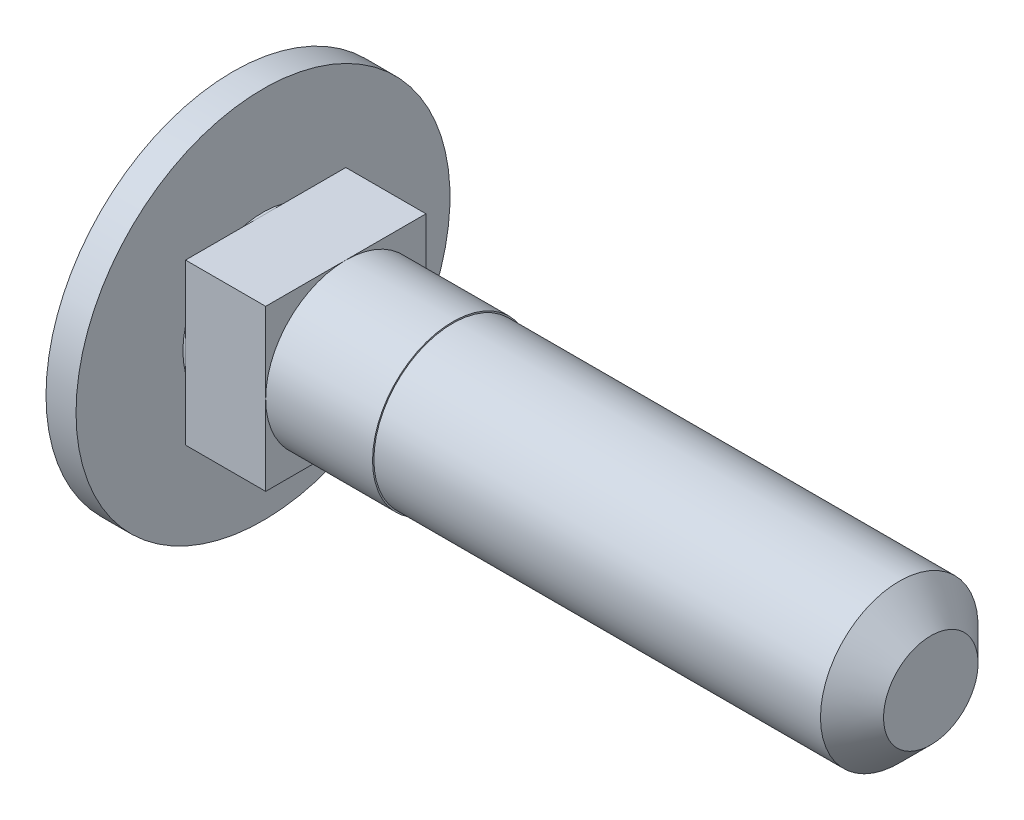
ISO-10303-21;
HEADER;
FILE_DESCRIPTION(('STEP AP214'),'2;1');
FILE_NAME('part.step','',(''),(''),'','','');
FILE_SCHEMA(('AUTOMOTIVE_DESIGN { 1 0 10303 214 1 1 1 1 }'));
ENDSEC;
DATA;
#1=APPLICATION_CONTEXT('core data for automotive mechanical design processes');
#2=APPLICATION_PROTOCOL_DEFINITION('international standard','automotive_design',2000,#1);
#3=PRODUCT_CONTEXT('',#1,'mechanical');
#4=PRODUCT('Part','Part','',(#3));
#5=PRODUCT_RELATED_PRODUCT_CATEGORY('part','',(#4));
#6=PRODUCT_DEFINITION_FORMATION('','',#4);
#7=PRODUCT_DEFINITION_CONTEXT('part definition',#1,'design');
#8=PRODUCT_DEFINITION('design','',#6,#7);
#9=PRODUCT_DEFINITION_SHAPE('','',#8);
#10=(LENGTH_UNIT() NAMED_UNIT(*) SI_UNIT(.MILLI.,.METRE.));
#11=(NAMED_UNIT(*) PLANE_ANGLE_UNIT() SI_UNIT($,.RADIAN.));
#12=(NAMED_UNIT(*) SI_UNIT($,.STERADIAN.) SOLID_ANGLE_UNIT());
#13=UNCERTAINTY_MEASURE_WITH_UNIT(LENGTH_MEASURE(1.E-05),#10,'distance_accuracy_value','');
#14=(GEOMETRIC_REPRESENTATION_CONTEXT(3) GLOBAL_UNCERTAINTY_ASSIGNED_CONTEXT((#13)) GLOBAL_UNIT_ASSIGNED_CONTEXT((#10,
#11,#12)) REPRESENTATION_CONTEXT('',''));
#15=CARTESIAN_POINT('',(0.,0.,0.));
#16=DIRECTION('',(0.,0.,1.));
#17=DIRECTION('',(1.,0.,0.));
#18=AXIS2_PLACEMENT_3D('',#15,#16,#17);
#19=CARTESIAN_POINT('',(25.,0.,0.));
#20=DIRECTION('',(-1.,0.,0.));
#21=DIRECTION('',(0.,0.,1.));
#22=AXIS2_PLACEMENT_3D('',#19,#20,#21);
#23=PLANE('',#22);
#24=CARTESIAN_POINT('',(25.,0.,0.));
#25=DIRECTION('',(-1.,0.,0.));
#26=DIRECTION('',(0.,0.,1.));
#27=AXIS2_PLACEMENT_3D('',#24,#25,#26);
#28=CIRCLE('',#27,1.77000000000004);
#29=CARTESIAN_POINT('',(25.,0.,1.77000000000004));
#30=VERTEX_POINT('',#29);
#31=EDGE_CURVE('E11',#30,#30,#28,.F.);
#32=ORIENTED_EDGE('',*,*,#31,.T.);
#33=EDGE_LOOP('',(#32));
#34=FACE_BOUND('',#33,.T.);
#35=ADVANCED_FACE('F37',(#34),#23,.F.);
#36=CARTESIAN_POINT('',(-121.430503084695,0.,0.));
#37=DIRECTION('',(-1.,0.,0.));
#38=DIRECTION('',(0.,0.,1.));
#39=AXIS2_PLACEMENT_3D('',#36,#37,#38);
#40=CYLINDRICAL_SURFACE('',#39,2.95000000000001);
#41=CARTESIAN_POINT('',(23.82,0.,0.));
#42=DIRECTION('',(-1.,0.,0.));
#43=DIRECTION('',(0.,0.,1.));
#44=AXIS2_PLACEMENT_3D('',#41,#42,#43);
#45=CIRCLE('',#44,2.95000000000001);
#46=CARTESIAN_POINT('',(23.82,0.,2.95000000000001));
#47=VERTEX_POINT('',#46);
#48=EDGE_CURVE('E45',#47,#47,#45,.T.);
#49=ORIENTED_EDGE('',*,*,#48,.T.);
#50=EDGE_LOOP('',(#49));
#51=FACE_BOUND('',#50,.T.);
#52=CARTESIAN_POINT('',(7.10000000000001,0.,0.));
#53=DIRECTION('',(-1.,0.,0.));
#54=DIRECTION('',(0.,0.,1.));
#55=AXIS2_PLACEMENT_3D('',#52,#53,#54);
#56=CIRCLE('',#55,2.95);
#57=CARTESIAN_POINT('',(7.10000000000001,0.,2.95));
#58=VERTEX_POINT('',#57);
#59=EDGE_CURVE('E147',#58,#58,#56,.T.);
#60=ORIENTED_EDGE('',*,*,#59,.F.);
#61=EDGE_LOOP('',(#60));
#62=FACE_BOUND('',#61,.T.);
#63=ADVANCED_FACE('F226',(#51,#62),#40,.T.);
#64=CARTESIAN_POINT('',(7.1,2.95,0.));
#65=DIRECTION('',(-1.,0.,0.));
#66=DIRECTION('',(0.,0.,1.));
#67=AXIS2_PLACEMENT_3D('',#64,#65,#66);
#68=PLANE('',#67);
#69=CARTESIAN_POINT('',(7.10000000000001,0.,0.));
#70=DIRECTION('',(-1.,0.,0.));
#71=DIRECTION('',(0.,0.,1.));
#72=AXIS2_PLACEMENT_3D('',#69,#70,#71);
#73=CIRCLE('',#72,3.);
#74=CARTESIAN_POINT('',(7.10000000000001,0.,3.));
#75=VERTEX_POINT('',#74);
#76=EDGE_CURVE('E144',#75,#75,#73,.T.);
#77=ORIENTED_EDGE('',*,*,#76,.F.);
#78=EDGE_LOOP('',(#77));
#79=FACE_BOUND('',#78,.T.);
#80=ORIENTED_EDGE('',*,*,#59,.T.);
#81=EDGE_LOOP('',(#80));
#82=FACE_BOUND('',#81,.T.);
#83=ADVANCED_FACE('F231',(#79,#82),#68,.F.);
#84=CARTESIAN_POINT('',(-121.430503084695,0.,0.));
#85=DIRECTION('',(-1.,0.,0.));
#86=DIRECTION('',(0.,0.,1.));
#87=AXIS2_PLACEMENT_3D('',#84,#85,#86);
#88=CYLINDRICAL_SURFACE('',#87,3.00000000000001);
#89=CARTESIAN_POINT('',(3.10000000000001,0.,0.));
#90=DIRECTION('',(1.,0.,0.));
#91=DIRECTION('',(0.,0.,-1.));
#92=AXIS2_PLACEMENT_3D('',#89,#90,#91);
#93=CIRCLE('',#92,3.00000000000001);
#94=CARTESIAN_POINT('',(3.10000000000001,-3.,0.));
#95=VERTEX_POINT('',#94);
#96=CARTESIAN_POINT('',(3.10000000000001,0.,-3.00000000000001));
#97=VERTEX_POINT('',#96);
#98=EDGE_CURVE('E155',#95,#97,#93,.T.);
#99=ORIENTED_EDGE('',*,*,#98,.T.);
#100=CARTESIAN_POINT('',(3.10000000000001,3.,0.));
#101=VERTEX_POINT('',#100);
#102=EDGE_CURVE('E107',#97,#101,#93,.T.);
#103=ORIENTED_EDGE('',*,*,#102,.T.);
#104=CARTESIAN_POINT('',(3.10000000000001,0.,3.));
#105=VERTEX_POINT('',#104);
#106=EDGE_CURVE('E160',#101,#105,#93,.T.);
#107=ORIENTED_EDGE('',*,*,#106,.T.);
#108=EDGE_CURVE('E156',#105,#95,#93,.T.);
#109=ORIENTED_EDGE('',*,*,#108,.T.);
#110=EDGE_LOOP('',(#99,#103,#107,#109));
#111=FACE_BOUND('',#110,.T.);
#112=ORIENTED_EDGE('',*,*,#76,.T.);
#113=EDGE_LOOP('',(#112));
#114=FACE_BOUND('',#113,.T.);
#115=ADVANCED_FACE('F164',(#111,#114),#88,.T.);
#116=CARTESIAN_POINT('',(3.1,3.,-3.));
#117=DIRECTION('',(0.,0.,1.));
#118=DIRECTION('',(0.,-1.,0.));
#119=AXIS2_PLACEMENT_3D('',#116,#117,#118);
#120=PLANE('',#119);
#121=DIRECTION('',(0.,1.,0.));
#122=VECTOR('',#121,1.);
#123=CARTESIAN_POINT('',(3.1,3.,-3.));
#124=LINE('',#123,#122);
#125=CARTESIAN_POINT('',(3.1,3.,-3.));
#126=VERTEX_POINT('',#125);
#127=EDGE_CURVE('E102',#97,#126,#124,.T.);
#128=ORIENTED_EDGE('',*,*,#127,.F.);
#129=CARTESIAN_POINT('',(3.1,-3.,-3.));
#130=VERTEX_POINT('',#129);
#131=EDGE_CURVE('E52',#130,#97,#124,.T.);
#132=ORIENTED_EDGE('',*,*,#131,.F.);
#133=DIRECTION('',(-1.,0.,0.));
#134=VECTOR('',#133,1.);
#135=CARTESIAN_POINT('',(3.1,-3.,-3.));
#136=LINE('',#135,#134);
#137=CARTESIAN_POINT('',(0.1,-3.,-3.));
#138=VERTEX_POINT('',#137);
#139=EDGE_CURVE('E185',#130,#138,#136,.T.);
#140=ORIENTED_EDGE('',*,*,#139,.T.);
#141=DIRECTION('',(0.,1.,0.));
#142=VECTOR('',#141,1.);
#143=CARTESIAN_POINT('',(0.1,3.,-3.));
#144=LINE('',#143,#142);
#145=CARTESIAN_POINT('',(0.100000000000003,0.,-3.));
#146=VERTEX_POINT('',#145);
#147=EDGE_CURVE('E186',#138,#146,#144,.T.);
#148=ORIENTED_EDGE('',*,*,#147,.T.);
#149=CARTESIAN_POINT('',(0.1,3.,-3.));
#150=VERTEX_POINT('',#149);
#151=EDGE_CURVE('E126',#146,#150,#144,.T.);
#152=ORIENTED_EDGE('',*,*,#151,.T.);
#153=DIRECTION('',(-1.,0.,0.));
#154=VECTOR('',#153,1.);
#155=CARTESIAN_POINT('',(3.1,3.,-3.));
#156=LINE('',#155,#154);
#157=EDGE_CURVE('E118',#126,#150,#156,.T.);
#158=ORIENTED_EDGE('',*,*,#157,.F.);
#159=EDGE_LOOP('',(#128,#132,#140,#148,#152,#158));
#160=FACE_BOUND('',#159,.T.);
#161=ADVANCED_FACE('F123',(#160),#120,.F.);
#162=CARTESIAN_POINT('',(3.1,3.,3.));
#163=DIRECTION('',(0.,-1.,0.));
#164=DIRECTION('',(0.,0.,-1.));
#165=AXIS2_PLACEMENT_3D('',#162,#163,#164);
#166=PLANE('',#165);
#167=DIRECTION('',(0.,0.,1.));
#168=VECTOR('',#167,1.);
#169=CARTESIAN_POINT('',(3.1,3.,3.));
#170=LINE('',#169,#168);
#171=CARTESIAN_POINT('',(3.1,3.,3.));
#172=VERTEX_POINT('',#171);
#173=EDGE_CURVE('E120',#101,#172,#170,.T.);
#174=ORIENTED_EDGE('',*,*,#173,.F.);
#175=EDGE_CURVE('E105',#126,#101,#170,.T.);
#176=ORIENTED_EDGE('',*,*,#175,.F.);
#177=ORIENTED_EDGE('',*,*,#157,.T.);
#178=DIRECTION('',(0.,0.,1.));
#179=VECTOR('',#178,1.);
#180=CARTESIAN_POINT('',(0.1,3.,3.));
#181=LINE('',#180,#179);
#182=CARTESIAN_POINT('',(0.100000000000003,3.,0.));
#183=VERTEX_POINT('',#182);
#184=EDGE_CURVE('E189',#150,#183,#181,.T.);
#185=ORIENTED_EDGE('',*,*,#184,.T.);
#186=CARTESIAN_POINT('',(0.1,3.,3.));
#187=VERTEX_POINT('',#186);
#188=EDGE_CURVE('E188',#183,#187,#181,.T.);
#189=ORIENTED_EDGE('',*,*,#188,.T.);
#190=DIRECTION('',(-1.,0.,0.));
#191=VECTOR('',#190,1.);
#192=CARTESIAN_POINT('',(3.1,3.,3.));
#193=LINE('',#192,#191);
#194=EDGE_CURVE('E129',#172,#187,#193,.T.);
#195=ORIENTED_EDGE('',*,*,#194,.F.);
#196=EDGE_LOOP('',(#174,#176,#177,#185,#189,#195));
#197=FACE_BOUND('',#196,.T.);
#198=ADVANCED_FACE('F116',(#197),#166,.F.);
#199=CARTESIAN_POINT('',(3.1,3.,3.));
#200=DIRECTION('',(0.,0.,-1.));
#201=DIRECTION('',(0.,1.,0.));
#202=AXIS2_PLACEMENT_3D('',#199,#200,#201);
#203=PLANE('',#202);
#204=DIRECTION('',(0.,-1.,0.));
#205=VECTOR('',#204,1.);
#206=CARTESIAN_POINT('',(3.1,3.,3.));
#207=LINE('',#206,#205);
#208=CARTESIAN_POINT('',(3.1,-3.,3.));
#209=VERTEX_POINT('',#208);
#210=EDGE_CURVE('E121',#105,#209,#207,.T.);
#211=ORIENTED_EDGE('',*,*,#210,.F.);
#212=EDGE_CURVE('E177',#172,#105,#207,.T.);
#213=ORIENTED_EDGE('',*,*,#212,.F.);
#214=ORIENTED_EDGE('',*,*,#194,.T.);
#215=DIRECTION('',(0.,-1.,0.));
#216=VECTOR('',#215,1.);
#217=CARTESIAN_POINT('',(0.1,3.,3.));
#218=LINE('',#217,#216);
#219=CARTESIAN_POINT('',(0.100000000000003,0.,3.));
#220=VERTEX_POINT('',#219);
#221=EDGE_CURVE('E192',#187,#220,#218,.T.);
#222=ORIENTED_EDGE('',*,*,#221,.T.);
#223=CARTESIAN_POINT('',(0.1,-3.,3.));
#224=VERTEX_POINT('',#223);
#225=EDGE_CURVE('E191',#220,#224,#218,.T.);
#226=ORIENTED_EDGE('',*,*,#225,.T.);
#227=DIRECTION('',(-1.,0.,0.));
#228=VECTOR('',#227,1.);
#229=CARTESIAN_POINT('',(3.1,-3.,3.));
#230=LINE('',#229,#228);
#231=EDGE_CURVE('E135',#209,#224,#230,.T.);
#232=ORIENTED_EDGE('',*,*,#231,.F.);
#233=EDGE_LOOP('',(#211,#213,#214,#222,#226,#232));
#234=FACE_BOUND('',#233,.T.);
#235=ADVANCED_FACE('F176',(#234),#203,.F.);
#236=CARTESIAN_POINT('',(3.1,-3.,3.));
#237=DIRECTION('',(0.,1.,0.));
#238=DIRECTION('',(0.,0.,1.));
#239=AXIS2_PLACEMENT_3D('',#236,#237,#238);
#240=PLANE('',#239);
#241=DIRECTION('',(0.,0.,-1.));
#242=VECTOR('',#241,1.);
#243=CARTESIAN_POINT('',(3.1,-3.,3.));
#244=LINE('',#243,#242);
#245=EDGE_CURVE('E182',#95,#130,#244,.T.);
#246=ORIENTED_EDGE('',*,*,#245,.F.);
#247=EDGE_CURVE('E172',#209,#95,#244,.T.);
#248=ORIENTED_EDGE('',*,*,#247,.F.);
#249=ORIENTED_EDGE('',*,*,#231,.T.);
#250=DIRECTION('',(0.,0.,-1.));
#251=VECTOR('',#250,1.);
#252=CARTESIAN_POINT('',(0.1,-3.,3.));
#253=LINE('',#252,#251);
#254=CARTESIAN_POINT('',(0.100000000000003,-3.,0.));
#255=VERTEX_POINT('',#254);
#256=EDGE_CURVE('E111',#224,#255,#253,.T.);
#257=ORIENTED_EDGE('',*,*,#256,.T.);
#258=EDGE_CURVE('E195',#255,#138,#253,.T.);
#259=ORIENTED_EDGE('',*,*,#258,.T.);
#260=ORIENTED_EDGE('',*,*,#139,.F.);
#261=EDGE_LOOP('',(#246,#248,#249,#257,#259,#260));
#262=FACE_BOUND('',#261,.T.);
#263=ADVANCED_FACE('F202',(#262),#240,.F.);
#264=CARTESIAN_POINT('',(3.1,0.,0.));
#265=DIRECTION('',(1.,0.,0.));
#266=DIRECTION('',(0.,0.,-1.));
#267=AXIS2_PLACEMENT_3D('',#264,#265,#266);
#268=PLANE('',#267);
#269=ORIENTED_EDGE('',*,*,#102,.F.);
#270=ORIENTED_EDGE('',*,*,#127,.T.);
#271=ORIENTED_EDGE('',*,*,#175,.T.);
#272=EDGE_LOOP('',(#269,#270,#271));
#273=FACE_BOUND('',#272,.T.);
#274=ADVANCED_FACE('F104',(#273),#268,.T.);
#275=ORIENTED_EDGE('',*,*,#106,.F.);
#276=ORIENTED_EDGE('',*,*,#173,.T.);
#277=ORIENTED_EDGE('',*,*,#212,.T.);
#278=EDGE_LOOP('',(#275,#276,#277));
#279=FACE_BOUND('',#278,.T.);
#280=ADVANCED_FACE('F181',(#279),#268,.T.);
#281=ORIENTED_EDGE('',*,*,#108,.F.);
#282=ORIENTED_EDGE('',*,*,#210,.T.);
#283=ORIENTED_EDGE('',*,*,#247,.T.);
#284=EDGE_LOOP('',(#281,#282,#283));
#285=FACE_BOUND('',#284,.T.);
#286=ADVANCED_FACE('F169',(#285),#268,.T.);
#287=CARTESIAN_POINT('',(0.1,0.,0.));
#288=DIRECTION('',(1.,0.,0.));
#289=DIRECTION('',(0.,0.,-1.));
#290=AXIS2_PLACEMENT_3D('',#287,#288,#289);
#291=PLANE('',#290);
#292=ORIENTED_EDGE('',*,*,#151,.F.);
#293=CARTESIAN_POINT('',(0.100000000000003,0.,0.));
#294=DIRECTION('',(1.,0.,0.));
#295=DIRECTION('',(0.,0.,-1.));
#296=AXIS2_PLACEMENT_3D('',#293,#294,#295);
#297=CIRCLE('',#296,3.00000000000001);
#298=EDGE_CURVE('E154',#146,#183,#297,.T.);
#299=ORIENTED_EDGE('',*,*,#298,.T.);
#300=ORIENTED_EDGE('',*,*,#184,.F.);
#301=EDGE_LOOP('',(#292,#299,#300));
#302=FACE_BOUND('',#301,.T.);
#303=ADVANCED_FACE('F221',(#302),#291,.F.);
#304=ORIENTED_EDGE('',*,*,#188,.F.);
#305=EDGE_CURVE('E60',#183,#220,#297,.T.);
#306=ORIENTED_EDGE('',*,*,#305,.T.);
#307=ORIENTED_EDGE('',*,*,#221,.F.);
#308=EDGE_LOOP('',(#304,#306,#307));
#309=FACE_BOUND('',#308,.T.);
#310=ADVANCED_FACE('F222',(#309),#291,.F.);
#311=ORIENTED_EDGE('',*,*,#225,.F.);
#312=EDGE_CURVE('E153',#220,#255,#297,.T.);
#313=ORIENTED_EDGE('',*,*,#312,.T.);
#314=ORIENTED_EDGE('',*,*,#256,.F.);
#315=EDGE_LOOP('',(#311,#313,#314));
#316=FACE_BOUND('',#315,.T.);
#317=ADVANCED_FACE('F206',(#316),#291,.F.);
#318=ORIENTED_EDGE('',*,*,#98,.F.);
#319=ORIENTED_EDGE('',*,*,#245,.T.);
#320=ORIENTED_EDGE('',*,*,#131,.T.);
#321=EDGE_LOOP('',(#318,#319,#320));
#322=FACE_BOUND('',#321,.T.);
#323=ADVANCED_FACE('F212',(#322),#268,.T.);
#324=ORIENTED_EDGE('',*,*,#258,.F.);
#325=EDGE_CURVE('E150',#255,#146,#297,.T.);
#326=ORIENTED_EDGE('',*,*,#325,.T.);
#327=ORIENTED_EDGE('',*,*,#147,.F.);
#328=EDGE_LOOP('',(#324,#326,#327));
#329=FACE_BOUND('',#328,.T.);
#330=ADVANCED_FACE('F210',(#329),#291,.F.);
#331=CARTESIAN_POINT('',(11.,0.,0.));
#332=DIRECTION('',(-1.,0.,0.));
#333=DIRECTION('',(0.,1.,0.));
#334=AXIS2_PLACEMENT_3D('',#331,#332,#333);
#335=SPHERICAL_SURFACE('',#334,14.);
#336=CARTESIAN_POINT('',(-1.12435565298215,0.,0.));
#337=DIRECTION('',(-1.,0.,0.));
#338=DIRECTION('',(0.,0.,1.));
#339=AXIS2_PLACEMENT_3D('',#336,#337,#338);
#340=CIRCLE('',#339,7.);
#341=CARTESIAN_POINT('',(-1.12435565298215,0.,7.));
#342=VERTEX_POINT('',#341);
#343=EDGE_CURVE('E128',#342,#342,#340,.T.);
#344=ORIENTED_EDGE('',*,*,#343,.T.);
#345=EDGE_LOOP('',(#344));
#346=FACE_BOUND('',#345,.T.);
#347=ADVANCED_FACE('F219',(#346),#335,.T.);
#348=CARTESIAN_POINT('',(-121.430503084695,0.,0.));
#349=DIRECTION('',(-1.,0.,0.));
#350=DIRECTION('',(0.,0.,1.));
#351=AXIS2_PLACEMENT_3D('',#348,#349,#350);
#352=CYLINDRICAL_SURFACE('',#351,7.);
#353=ORIENTED_EDGE('',*,*,#343,.F.);
#354=EDGE_LOOP('',(#353));
#355=FACE_BOUND('',#354,.T.);
#356=CARTESIAN_POINT('',(0.,0.,0.));
#357=DIRECTION('',(-1.,0.,0.));
#358=DIRECTION('',(0.,0.,1.));
#359=AXIS2_PLACEMENT_3D('',#356,#357,#358);
#360=CIRCLE('',#359,7.);
#361=CARTESIAN_POINT('',(0.,0.,7.));
#362=VERTEX_POINT('',#361);
#363=EDGE_CURVE('E132',#362,#362,#360,.T.);
#364=ORIENTED_EDGE('',*,*,#363,.T.);
#365=EDGE_LOOP('',(#364));
#366=FACE_BOUND('',#365,.T.);
#367=ADVANCED_FACE('F243',(#355,#366),#352,.T.);
#368=CARTESIAN_POINT('',(0.,3.00000000000002,0.));
#369=DIRECTION('',(-1.,0.,0.));
#370=DIRECTION('',(0.,0.,1.));
#371=AXIS2_PLACEMENT_3D('',#368,#369,#370);
#372=PLANE('',#371);
#373=ORIENTED_EDGE('',*,*,#363,.F.);
#374=EDGE_LOOP('',(#373));
#375=FACE_BOUND('',#374,.T.);
#376=CARTESIAN_POINT('',(0.,0.,0.));
#377=DIRECTION('',(-1.,0.,0.));
#378=DIRECTION('',(0.,0.,1.));
#379=AXIS2_PLACEMENT_3D('',#376,#377,#378);
#380=CIRCLE('',#379,3.00000000000002);
#381=CARTESIAN_POINT('',(0.,0.,3.00000000000002));
#382=VERTEX_POINT('',#381);
#383=EDGE_CURVE('E141',#382,#382,#380,.T.);
#384=ORIENTED_EDGE('',*,*,#383,.T.);
#385=EDGE_LOOP('',(#384));
#386=FACE_BOUND('',#385,.T.);
#387=ADVANCED_FACE('F240',(#375,#386),#372,.F.);
#388=ORIENTED_EDGE('',*,*,#383,.F.);
#389=EDGE_LOOP('',(#388));
#390=FACE_BOUND('',#389,.T.);
#391=ORIENTED_EDGE('',*,*,#298,.F.);
#392=ORIENTED_EDGE('',*,*,#325,.F.);
#393=ORIENTED_EDGE('',*,*,#312,.F.);
#394=ORIENTED_EDGE('',*,*,#305,.F.);
#395=EDGE_LOOP('',(#391,#392,#393,#394));
#396=FACE_BOUND('',#395,.T.);
#397=ADVANCED_FACE('F239',(#390,#396),#88,.T.);
#398=CARTESIAN_POINT('',(23.82,0.,0.));
#399=DIRECTION('',(-1.,0.,0.));
#400=DIRECTION('',(0.,0.,1.));
#401=AXIS2_PLACEMENT_3D('',#398,#399,#400);
#402=CONICAL_SURFACE('',#401,2.95000000000001,0.785398163397447);
#403=ORIENTED_EDGE('',*,*,#31,.F.);
#404=EDGE_LOOP('',(#403));
#405=FACE_BOUND('',#404,.T.);
#406=ORIENTED_EDGE('',*,*,#48,.F.);
#407=EDGE_LOOP('',(#406));
#408=FACE_BOUND('',#407,.T.);
#409=ADVANCED_FACE('F39',(#405,#408),#402,.T.);
#410=CLOSED_SHELL('',(#35,#63,#83,#115,#161,#198,#235,#263,#274,#280,#286,#303,#310,#317,#323,
#330,#347,#367,#387,#397,#409));
#411=MANIFOLD_SOLID_BREP('B2',#410);
#412=ADVANCED_BREP_SHAPE_REPRESENTATION('',(#18,#411),#14);
#413=SHAPE_DEFINITION_REPRESENTATION(#9,#412);
ENDSEC;
END-ISO-10303-21;
